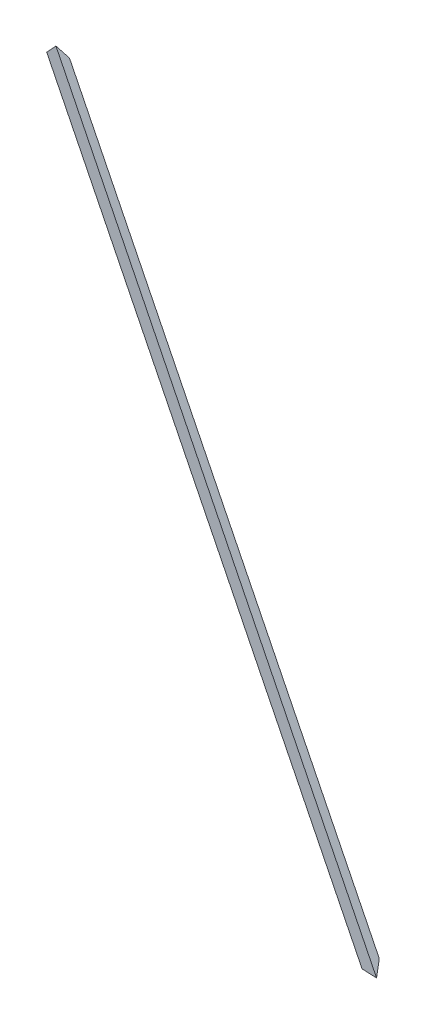
ISO-10303-21;
HEADER;
FILE_DESCRIPTION(('STEP AP214'),'2;1');
FILE_NAME('part.step','',(''),(''),'','','');
FILE_SCHEMA(('AUTOMOTIVE_DESIGN { 1 0 10303 214 1 1 1 1 }'));
ENDSEC;
DATA;
#1=APPLICATION_CONTEXT('core data for automotive mechanical design processes');
#2=APPLICATION_PROTOCOL_DEFINITION('international standard','automotive_design',2000,#1);
#3=PRODUCT_CONTEXT('',#1,'mechanical');
#4=PRODUCT('Part','Part','',(#3));
#5=PRODUCT_RELATED_PRODUCT_CATEGORY('part','',(#4));
#6=PRODUCT_DEFINITION_FORMATION('','',#4);
#7=PRODUCT_DEFINITION_CONTEXT('part definition',#1,'design');
#8=PRODUCT_DEFINITION('design','',#6,#7);
#9=PRODUCT_DEFINITION_SHAPE('','',#8);
#10=(LENGTH_UNIT() NAMED_UNIT(*) SI_UNIT(.MILLI.,.METRE.));
#11=(NAMED_UNIT(*) PLANE_ANGLE_UNIT() SI_UNIT($,.RADIAN.));
#12=(NAMED_UNIT(*) SI_UNIT($,.STERADIAN.) SOLID_ANGLE_UNIT());
#13=UNCERTAINTY_MEASURE_WITH_UNIT(LENGTH_MEASURE(1.E-05),#10,'distance_accuracy_value','');
#14=(GEOMETRIC_REPRESENTATION_CONTEXT(3) GLOBAL_UNCERTAINTY_ASSIGNED_CONTEXT((#13)) GLOBAL_UNIT_ASSIGNED_CONTEXT((#10,
#11,#12)) REPRESENTATION_CONTEXT('',''));
#15=CARTESIAN_POINT('',(0.,0.,0.));
#16=DIRECTION('',(0.,0.,1.));
#17=DIRECTION('',(1.,0.,0.));
#18=AXIS2_PLACEMENT_3D('',#15,#16,#17);
#19=CARTESIAN_POINT('',(8.27489711426208,3.16072944423935,-23.1905404722118));
#20=DIRECTION('',(-0.333333333333335,-0.127322003750022,0.934172358962717));
#21=DIRECTION('',(0.94183756467008,0.,0.336068448052377));
#22=AXIS2_PLACEMENT_3D('',#19,#20,#21);
#23=PLANE('',#22);
#24=DIRECTION('',(0.529104719738793,-0.845360491702087,0.0735787647309975));
#25=VECTOR('',#24,1.);
#26=CARTESIAN_POINT('',(4054.13965509926,4160.27682569343,1987.05298597522));
#27=LINE('',#26,#25);
#28=CARTESIAN_POINT('',(4054.13965509926,4160.27682569342,1987.05298597522));
#29=VERTEX_POINT('',#28);
#30=CARTESIAN_POINT('',(5350.15703681137,2089.60565194266,2167.28074516692));
#31=VERTEX_POINT('',#30);
#32=EDGE_CURVE('E65',#29,#31,#27,.T.);
#33=ORIENTED_EDGE('',*,*,#32,.F.);
#34=DIRECTION('',(-0.654469130781613,-0.681969712719904,-0.326477361828798));
#35=VECTOR('',#34,1.);
#36=CARTESIAN_POINT('',(4121.49633100109,4230.46380740741,2020.6533940246));
#37=LINE('',#36,#35);
#38=CARTESIAN_POINT('',(4121.4963310011,4230.46380740741,2020.6533940246));
#39=VERTEX_POINT('',#38);
#40=EDGE_CURVE('E18',#39,#29,#37,.T.);
#41=ORIENTED_EDGE('',*,*,#40,.F.);
#42=DIRECTION('',(0.529104719738794,-0.845360491702086,0.0735787647309978));
#43=VECTOR('',#42,1.);
#44=CARTESIAN_POINT('',(4121.49633100109,4230.46380740741,2020.6533940246));
#45=LINE('',#44,#43);
#46=CARTESIAN_POINT('',(5439.97134003124,2123.91166309677,2204.00417294228));
#47=VERTEX_POINT('',#46);
#48=EDGE_CURVE('E78',#39,#47,#45,.T.);
#49=ORIENTED_EDGE('',*,*,#48,.T.);
#50=DIRECTION('',(-0.872677996249969,-0.33333333333332,-0.356822089773092));
#51=VECTOR('',#50,1.);
#52=CARTESIAN_POINT('',(5439.97134003124,2123.91166309677,2204.00417294228));
#53=LINE('',#52,#51);
#54=EDGE_CURVE('E53',#47,#31,#53,.T.);
#55=ORIENTED_EDGE('',*,*,#54,.T.);
#56=EDGE_LOOP('',(#33,#41,#49,#55));
#57=FACE_BOUND('',#56,.T.);
#58=ADVANCED_FACE('F15',(#57),#23,.F.);
#59=CARTESIAN_POINT('',(0.,0.,0.));
#60=DIRECTION('',(-0.0650366103204272,0.480974248354035,-0.87431917040535));
#61=DIRECTION('',(0.,0.876174137459205,0.481994689646699));
#62=AXIS2_PLACEMENT_3D('',#59,#60,#61);
#63=PLANE('',#62);
#64=ORIENTED_EDGE('',*,*,#40,.T.);
#65=DIRECTION('',(0.57722234730505,-0.696579994970296,-0.426134570738905));
#66=VECTOR('',#65,1.);
#67=CARTESIAN_POINT('',(4025.58375883623,4194.73749092606,2008.13438494205));
#68=LINE('',#67,#66);
#69=CARTESIAN_POINT('',(4025.58375883623,4194.73749092607,2008.13438494205));
#70=VERTEX_POINT('',#69);
#71=EDGE_CURVE('E60',#70,#29,#68,.T.);
#72=ORIENTED_EDGE('',*,*,#71,.F.);
#73=DIRECTION('',(-0.654469130781648,-0.681969712719867,-0.326477361828805));
#74=VECTOR('',#73,1.);
#75=CARTESIAN_POINT('',(4092.94043473807,4264.92447264006,2041.73479299144));
#76=LINE('',#75,#74);
#77=CARTESIAN_POINT('',(4092.94043473807,4264.92447264006,2041.73479299144));
#78=VERTEX_POINT('',#77);
#79=EDGE_CURVE('E81',#78,#70,#76,.T.);
#80=ORIENTED_EDGE('',*,*,#79,.F.);
#81=DIRECTION('',(0.577222347305037,-0.696579994970164,-0.426134570739138));
#82=VECTOR('',#81,1.);
#83=CARTESIAN_POINT('',(4092.94043473806,4264.92447264005,2041.73479299145));
#84=LINE('',#83,#82);
#85=EDGE_CURVE('E63',#78,#39,#84,.T.);
#86=ORIENTED_EDGE('',*,*,#85,.T.);
#87=EDGE_LOOP('',(#64,#72,#80,#86));
#88=FACE_BOUND('',#87,.T.);
#89=ADVANCED_FACE('F58',(#88),#63,.T.);
#90=CARTESIAN_POINT('',(4866.54819190921,3168.83947547108,1412.06610784528));
#91=DIRECTION('',(-0.814278199040255,-0.530215010595009,-0.236269035439461));
#92=DIRECTION('',(0.545664026406652,-0.838004039540192,0.));
#93=AXIS2_PLACEMENT_3D('',#90,#91,#92);
#94=PLANE('',#93);
#95=ORIENTED_EDGE('',*,*,#71,.T.);
#96=ORIENTED_EDGE('',*,*,#32,.T.);
#97=DIRECTION('',(0.344646943269887,-0.769122902265749,0.538208552240704));
#98=VECTOR('',#97,1.);
#99=CARTESIAN_POINT('',(5350.15703681137,2089.60565194266,2167.28074516692));
#100=LINE('',#99,#98);
#101=CARTESIAN_POINT('',(5367.76786431786,2050.30488044998,2194.78221634237));
#102=VERTEX_POINT('',#101);
#103=EDGE_CURVE('E75',#31,#102,#100,.T.);
#104=ORIENTED_EDGE('',*,*,#103,.T.);
#105=DIRECTION('',(0.529104719738793,-0.845360491702086,0.0735787647309977));
#106=VECTOR('',#105,1.);
#107=CARTESIAN_POINT('',(4025.58375883623,4194.73749092606,2008.13438494205));
#108=LINE('',#107,#106);
#109=EDGE_CURVE('E71',#70,#102,#108,.T.);
#110=ORIENTED_EDGE('',*,*,#109,.F.);
#111=EDGE_LOOP('',(#95,#96,#104,#110));
#112=FACE_BOUND('',#111,.T.);
#113=ADVANCED_FACE('F69',(#112),#94,.T.);
#114=CARTESIAN_POINT('',(0.,0.,0.));
#115=DIRECTION('',(-0.467086179481353,0.356822089773098,0.809016994374947));
#116=DIRECTION('',(0.866025403784441,0.,0.499999999999996));
#117=AXIS2_PLACEMENT_3D('',#114,#115,#116);
#118=PLANE('',#117);
#119=ORIENTED_EDGE('',*,*,#103,.F.);
#120=ORIENTED_EDGE('',*,*,#54,.F.);
#121=DIRECTION('',(0.344646943269669,-0.769122902265601,0.538208552241055));
#122=VECTOR('',#121,1.);
#123=CARTESIAN_POINT('',(5439.97134003124,2123.91166309677,2204.00417294228));
#124=LINE('',#123,#122);
#125=CARTESIAN_POINT('',(5457.58216753774,2084.61089160408,2231.50564411772));
#126=VERTEX_POINT('',#125);
#127=EDGE_CURVE('E33',#47,#126,#124,.T.);
#128=ORIENTED_EDGE('',*,*,#127,.T.);
#129=DIRECTION('',(0.872677996249967,0.333333333333332,0.356822089773086));
#130=VECTOR('',#129,1.);
#131=CARTESIAN_POINT('',(5367.76786431786,2050.30488044998,2194.78221634237));
#132=LINE('',#131,#130);
#133=EDGE_CURVE('E24',#102,#126,#132,.T.);
#134=ORIENTED_EDGE('',*,*,#133,.F.);
#135=EDGE_LOOP('',(#119,#120,#128,#134));
#136=FACE_BOUND('',#135,.T.);
#137=ADVANCED_FACE('F87',(#136),#118,.F.);
#138=CARTESIAN_POINT('',(4947.97601181323,3221.86097653058,1435.69301138923));
#139=DIRECTION('',(-0.814278199040255,-0.530215010595009,-0.23626903543946));
#140=DIRECTION('',(0.545664026406652,-0.838004039540192,0.));
#141=AXIS2_PLACEMENT_3D('',#138,#139,#140);
#142=PLANE('',#141);
#143=ORIENTED_EDGE('',*,*,#127,.F.);
#144=ORIENTED_EDGE('',*,*,#48,.F.);
#145=ORIENTED_EDGE('',*,*,#85,.F.);
#146=DIRECTION('',(-0.529104719738789,0.845360491702089,-0.0735787647309956));
#147=VECTOR('',#146,1.);
#148=CARTESIAN_POINT('',(5457.58216753774,2084.61089160408,2231.50564411773));
#149=LINE('',#148,#147);
#150=EDGE_CURVE('E10',#126,#78,#149,.T.);
#151=ORIENTED_EDGE('',*,*,#150,.F.);
#152=EDGE_LOOP('',(#143,#144,#145,#151));
#153=FACE_BOUND('',#152,.T.);
#154=ADVANCED_FACE('F89',(#153),#142,.F.);
#155=CARTESIAN_POINT('',(0.,0.,0.));
#156=DIRECTION('',(-0.333333333333336,-0.127322003750022,0.934172358962717));
#157=DIRECTION('',(0.94183756467008,0.,0.336068448052377));
#158=AXIS2_PLACEMENT_3D('',#155,#156,#157);
#159=PLANE('',#158);
#160=ORIENTED_EDGE('',*,*,#133,.T.);
#161=ORIENTED_EDGE('',*,*,#150,.T.);
#162=ORIENTED_EDGE('',*,*,#79,.T.);
#163=ORIENTED_EDGE('',*,*,#109,.T.);
#164=EDGE_LOOP('',(#160,#161,#162,#163));
#165=FACE_BOUND('',#164,.T.);
#166=ADVANCED_FACE('F86',(#165),#159,.T.);
#167=CLOSED_SHELL('',(#58,#89,#113,#137,#154,#166));
#168=MANIFOLD_SOLID_BREP('B1',#167);
#169=ADVANCED_BREP_SHAPE_REPRESENTATION('',(#18,#168),#14);
#170=SHAPE_DEFINITION_REPRESENTATION(#9,#169);
ENDSEC;
END-ISO-10303-21;
